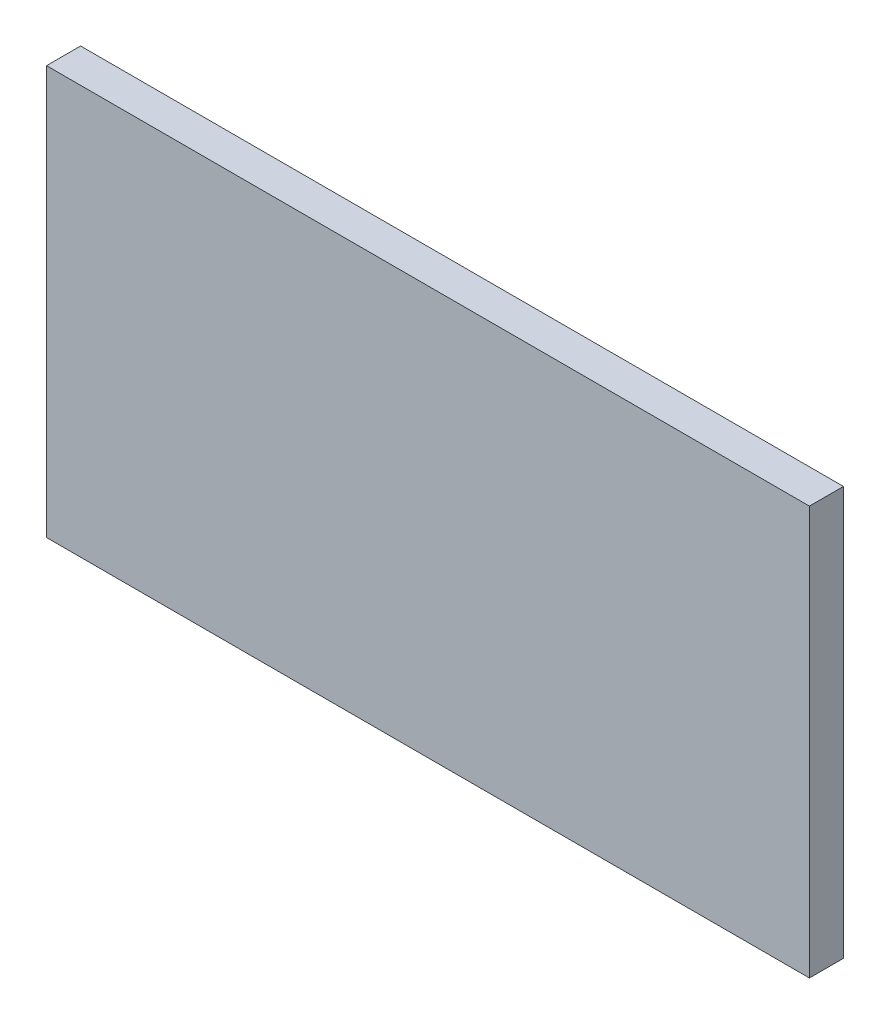
ISO-10303-21;
HEADER;
FILE_DESCRIPTION(('STEP AP214'),'2;1');
FILE_NAME('part.step','',(''),(''),'','','');
FILE_SCHEMA(('AUTOMOTIVE_DESIGN { 1 0 10303 214 1 1 1 1 }'));
ENDSEC;
DATA;
#1=APPLICATION_CONTEXT('core data for automotive mechanical design processes');
#2=APPLICATION_PROTOCOL_DEFINITION('international standard','automotive_design',2000,#1);
#3=PRODUCT_CONTEXT('',#1,'mechanical');
#4=PRODUCT('Part','Part','',(#3));
#5=PRODUCT_RELATED_PRODUCT_CATEGORY('part','',(#4));
#6=PRODUCT_DEFINITION_FORMATION('','',#4);
#7=PRODUCT_DEFINITION_CONTEXT('part definition',#1,'design');
#8=PRODUCT_DEFINITION('design','',#6,#7);
#9=PRODUCT_DEFINITION_SHAPE('','',#8);
#10=(LENGTH_UNIT() NAMED_UNIT(*) SI_UNIT(.MILLI.,.METRE.));
#11=(NAMED_UNIT(*) PLANE_ANGLE_UNIT() SI_UNIT($,.RADIAN.));
#12=(NAMED_UNIT(*) SI_UNIT($,.STERADIAN.) SOLID_ANGLE_UNIT());
#13=UNCERTAINTY_MEASURE_WITH_UNIT(LENGTH_MEASURE(1.E-05),#10,'distance_accuracy_value','');
#14=(GEOMETRIC_REPRESENTATION_CONTEXT(3) GLOBAL_UNCERTAINTY_ASSIGNED_CONTEXT((#13)) GLOBAL_UNIT_ASSIGNED_CONTEXT((#10,
#11,#12)) REPRESENTATION_CONTEXT('',''));
#15=CARTESIAN_POINT('',(0.,0.,0.));
#16=DIRECTION('',(0.,0.,1.));
#17=DIRECTION('',(1.,0.,0.));
#18=AXIS2_PLACEMENT_3D('',#15,#16,#17);
#19=CARTESIAN_POINT('',(0.,0.,3.175));
#20=DIRECTION('',(1.,0.,0.));
#21=DIRECTION('',(0.,0.,-1.));
#22=AXIS2_PLACEMENT_3D('',#19,#20,#21);
#23=PLANE('',#22);
#24=DIRECTION('',(0.,-1.,0.));
#25=VECTOR('',#24,1.);
#26=CARTESIAN_POINT('',(0.,0.,0.));
#27=LINE('',#26,#25);
#28=CARTESIAN_POINT('',(0.,38.1,0.));
#29=VERTEX_POINT('',#28);
#30=CARTESIAN_POINT('',(0.,0.,0.));
#31=VERTEX_POINT('',#30);
#32=EDGE_CURVE('E111',#29,#31,#27,.T.);
#33=ORIENTED_EDGE('',*,*,#32,.T.);
#34=DIRECTION('',(0.,0.,-1.));
#35=VECTOR('',#34,1.);
#36=CARTESIAN_POINT('',(0.,0.,3.175));
#37=LINE('',#36,#35);
#38=CARTESIAN_POINT('',(0.,0.,3.175));
#39=VERTEX_POINT('',#38);
#40=EDGE_CURVE('E11',#39,#31,#37,.T.);
#41=ORIENTED_EDGE('',*,*,#40,.F.);
#42=DIRECTION('',(0.,-1.,0.));
#43=VECTOR('',#42,1.);
#44=CARTESIAN_POINT('',(0.,0.,3.175));
#45=LINE('',#44,#43);
#46=CARTESIAN_POINT('',(0.,38.1,3.175));
#47=VERTEX_POINT('',#46);
#48=EDGE_CURVE('E94',#47,#39,#45,.T.);
#49=ORIENTED_EDGE('',*,*,#48,.F.);
#50=DIRECTION('',(0.,0.,-1.));
#51=VECTOR('',#50,1.);
#52=CARTESIAN_POINT('',(0.,38.1,3.175));
#53=LINE('',#52,#51);
#54=EDGE_CURVE('E107',#47,#29,#53,.T.);
#55=ORIENTED_EDGE('',*,*,#54,.T.);
#56=EDGE_LOOP('',(#33,#41,#49,#55));
#57=FACE_BOUND('',#56,.T.);
#58=ADVANCED_FACE('F39',(#57),#23,.F.);
#59=CARTESIAN_POINT('',(0.,0.,3.175));
#60=DIRECTION('',(0.,1.,0.));
#61=DIRECTION('',(0.,0.,1.));
#62=AXIS2_PLACEMENT_3D('',#59,#60,#61);
#63=PLANE('',#62);
#64=DIRECTION('',(1.,0.,0.));
#65=VECTOR('',#64,1.);
#66=CARTESIAN_POINT('',(0.,0.,0.));
#67=LINE('',#66,#65);
#68=CARTESIAN_POINT('',(71.12,0.,0.));
#69=VERTEX_POINT('',#68);
#70=EDGE_CURVE('E99',#31,#69,#67,.T.);
#71=ORIENTED_EDGE('',*,*,#70,.T.);
#72=DIRECTION('',(0.,0.,-1.));
#73=VECTOR('',#72,1.);
#74=CARTESIAN_POINT('',(71.12,0.,3.175));
#75=LINE('',#74,#73);
#76=CARTESIAN_POINT('',(71.12,0.,3.175));
#77=VERTEX_POINT('',#76);
#78=EDGE_CURVE('E47',#77,#69,#75,.T.);
#79=ORIENTED_EDGE('',*,*,#78,.F.);
#80=DIRECTION('',(1.,0.,0.));
#81=VECTOR('',#80,1.);
#82=CARTESIAN_POINT('',(0.,0.,3.175));
#83=LINE('',#82,#81);
#84=EDGE_CURVE('E88',#39,#77,#83,.T.);
#85=ORIENTED_EDGE('',*,*,#84,.F.);
#86=ORIENTED_EDGE('',*,*,#40,.T.);
#87=EDGE_LOOP('',(#71,#79,#85,#86));
#88=FACE_BOUND('',#87,.T.);
#89=ADVANCED_FACE('F98',(#88),#63,.F.);
#90=CARTESIAN_POINT('',(71.12,0.,3.175));
#91=DIRECTION('',(-1.,0.,0.));
#92=DIRECTION('',(0.,0.,1.));
#93=AXIS2_PLACEMENT_3D('',#90,#91,#92);
#94=PLANE('',#93);
#95=DIRECTION('',(0.,1.,0.));
#96=VECTOR('',#95,1.);
#97=CARTESIAN_POINT('',(71.12,0.,0.));
#98=LINE('',#97,#96);
#99=CARTESIAN_POINT('',(71.12,38.1,0.));
#100=VERTEX_POINT('',#99);
#101=EDGE_CURVE('E75',#69,#100,#98,.T.);
#102=ORIENTED_EDGE('',*,*,#101,.T.);
#103=DIRECTION('',(0.,0.,-1.));
#104=VECTOR('',#103,1.);
#105=CARTESIAN_POINT('',(71.12,38.1,3.175));
#106=LINE('',#105,#104);
#107=CARTESIAN_POINT('',(71.12,38.1,3.175));
#108=VERTEX_POINT('',#107);
#109=EDGE_CURVE('E101',#108,#100,#106,.T.);
#110=ORIENTED_EDGE('',*,*,#109,.F.);
#111=DIRECTION('',(0.,1.,0.));
#112=VECTOR('',#111,1.);
#113=CARTESIAN_POINT('',(71.12,0.,3.175));
#114=LINE('',#113,#112);
#115=EDGE_CURVE('E92',#77,#108,#114,.T.);
#116=ORIENTED_EDGE('',*,*,#115,.F.);
#117=ORIENTED_EDGE('',*,*,#78,.T.);
#118=EDGE_LOOP('',(#102,#110,#116,#117));
#119=FACE_BOUND('',#118,.T.);
#120=ADVANCED_FACE('F102',(#119),#94,.F.);
#121=CARTESIAN_POINT('',(0.,38.1,3.175));
#122=DIRECTION('',(0.,-1.,0.));
#123=DIRECTION('',(0.,0.,-1.));
#124=AXIS2_PLACEMENT_3D('',#121,#122,#123);
#125=PLANE('',#124);
#126=DIRECTION('',(-1.,0.,0.));
#127=VECTOR('',#126,1.);
#128=CARTESIAN_POINT('',(0.,38.1,0.));
#129=LINE('',#128,#127);
#130=EDGE_CURVE('E81',#100,#29,#129,.T.);
#131=ORIENTED_EDGE('',*,*,#130,.T.);
#132=ORIENTED_EDGE('',*,*,#54,.F.);
#133=DIRECTION('',(-1.,0.,0.));
#134=VECTOR('',#133,1.);
#135=CARTESIAN_POINT('',(0.,38.1,3.175));
#136=LINE('',#135,#134);
#137=EDGE_CURVE('E58',#108,#47,#136,.T.);
#138=ORIENTED_EDGE('',*,*,#137,.F.);
#139=ORIENTED_EDGE('',*,*,#109,.T.);
#140=EDGE_LOOP('',(#131,#132,#138,#139));
#141=FACE_BOUND('',#140,.T.);
#142=ADVANCED_FACE('F122',(#141),#125,.F.);
#143=CARTESIAN_POINT('',(0.,0.,3.175));
#144=DIRECTION('',(0.,0.,-1.));
#145=DIRECTION('',(-1.,0.,0.));
#146=AXIS2_PLACEMENT_3D('',#143,#144,#145);
#147=PLANE('',#146);
#148=ORIENTED_EDGE('',*,*,#48,.T.);
#149=ORIENTED_EDGE('',*,*,#84,.T.);
#150=ORIENTED_EDGE('',*,*,#115,.T.);
#151=ORIENTED_EDGE('',*,*,#137,.T.);
#152=EDGE_LOOP('',(#148,#149,#150,#151));
#153=FACE_BOUND('',#152,.T.);
#154=ADVANCED_FACE('F90',(#153),#147,.F.);
#155=CARTESIAN_POINT('',(0.,0.,0.));
#156=DIRECTION('',(0.,0.,-1.));
#157=DIRECTION('',(-1.,0.,0.));
#158=AXIS2_PLACEMENT_3D('',#155,#156,#157);
#159=PLANE('',#158);
#160=ORIENTED_EDGE('',*,*,#32,.F.);
#161=ORIENTED_EDGE('',*,*,#130,.F.);
#162=ORIENTED_EDGE('',*,*,#101,.F.);
#163=ORIENTED_EDGE('',*,*,#70,.F.);
#164=EDGE_LOOP('',(#160,#161,#162,#163));
#165=FACE_BOUND('',#164,.T.);
#166=ADVANCED_FACE('F125',(#165),#159,.T.);
#167=CLOSED_SHELL('',(#58,#89,#120,#142,#154,#166));
#168=MANIFOLD_SOLID_BREP('B2',#167);
#169=ADVANCED_BREP_SHAPE_REPRESENTATION('',(#18,#168),#14);
#170=SHAPE_DEFINITION_REPRESENTATION(#9,#169);
ENDSEC;
END-ISO-10303-21;
